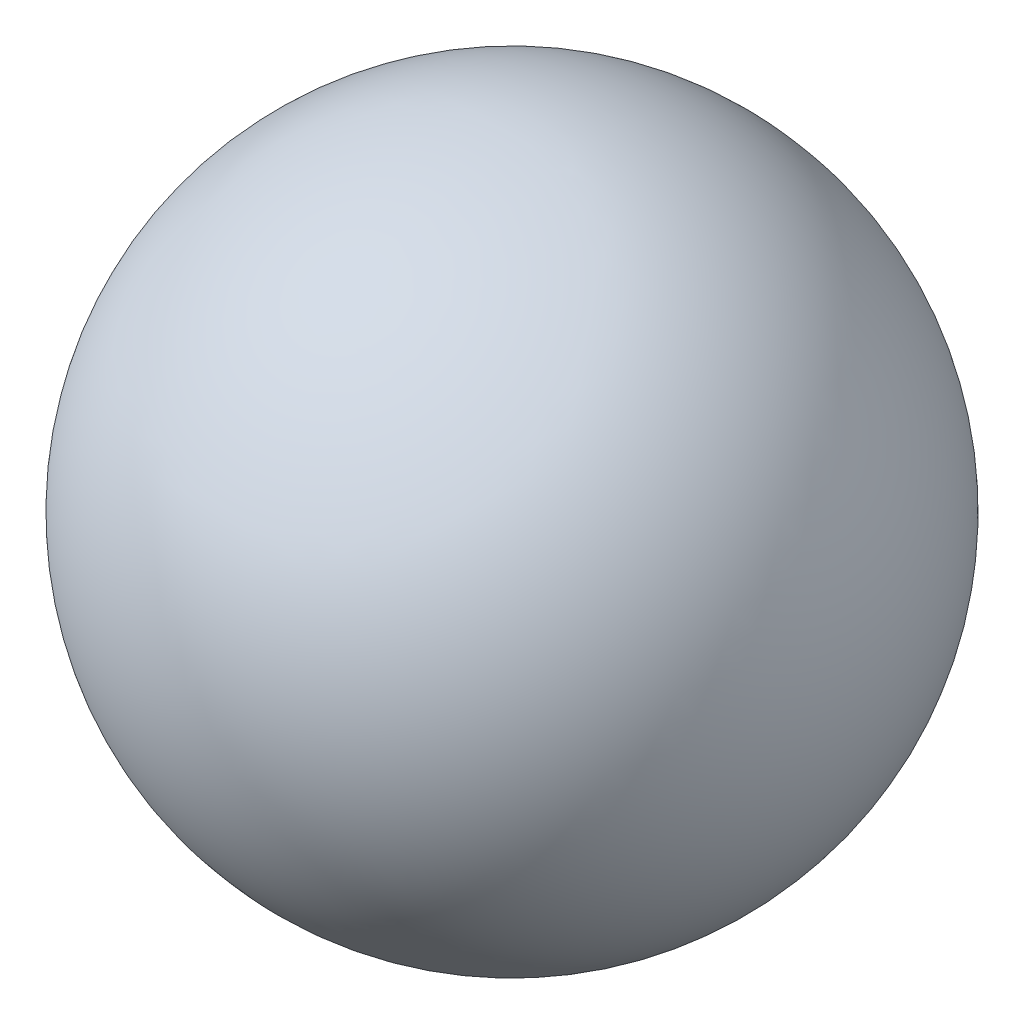
ISO-10303-21;
HEADER;
FILE_DESCRIPTION(('STEP AP214'),'2;1');
FILE_NAME('part.step','',(''),(''),'','','');
FILE_SCHEMA(('AUTOMOTIVE_DESIGN { 1 0 10303 214 1 1 1 1 }'));
ENDSEC;
DATA;
#1=APPLICATION_CONTEXT('core data for automotive mechanical design processes');
#2=APPLICATION_PROTOCOL_DEFINITION('international standard','automotive_design',2000,#1);
#3=PRODUCT_CONTEXT('',#1,'mechanical');
#4=PRODUCT('Part','Part','',(#3));
#5=PRODUCT_RELATED_PRODUCT_CATEGORY('part','',(#4));
#6=PRODUCT_DEFINITION_FORMATION('','',#4);
#7=PRODUCT_DEFINITION_CONTEXT('part definition',#1,'design');
#8=PRODUCT_DEFINITION('design','',#6,#7);
#9=PRODUCT_DEFINITION_SHAPE('','',#8);
#10=(LENGTH_UNIT() NAMED_UNIT(*) SI_UNIT(.MILLI.,.METRE.));
#11=(NAMED_UNIT(*) PLANE_ANGLE_UNIT() SI_UNIT($,.RADIAN.));
#12=(NAMED_UNIT(*) SI_UNIT($,.STERADIAN.) SOLID_ANGLE_UNIT());
#13=UNCERTAINTY_MEASURE_WITH_UNIT(LENGTH_MEASURE(1.E-05),#10,'distance_accuracy_value','');
#14=(GEOMETRIC_REPRESENTATION_CONTEXT(3) GLOBAL_UNCERTAINTY_ASSIGNED_CONTEXT((#13)) GLOBAL_UNIT_ASSIGNED_CONTEXT((#10,
#11,#12)) REPRESENTATION_CONTEXT('',''));
#15=CARTESIAN_POINT('',(0.,0.,0.));
#16=DIRECTION('',(0.,0.,1.));
#17=DIRECTION('',(1.,0.,0.));
#18=AXIS2_PLACEMENT_3D('',#15,#16,#17);
#19=CARTESIAN_POINT('',(67.76,36.5475393620934,-58.9351603274839));
#20=DIRECTION('',(0.,0.527020287134986,-0.84985270308928));
#21=DIRECTION('',(0.173648177666934,0.836941530920705,0.519013664765254));
#22=AXIS2_PLACEMENT_3D('',#19,#20,#21);
#23=SPHERICAL_SURFACE('',#22,7.15);
#24=CARTESIAN_POINT('',(67.76,40.3157344151086,-65.0116071545723));
#25=VERTEX_POINT('',#24);
#26=VERTEX_LOOP('',#25);
#27=FACE_BOUND('',#26,.T.);
#28=CARTESIAN_POINT('',(67.76,32.7793443090783,-52.8587135003955));
#29=VERTEX_POINT('',#28);
#30=VERTEX_LOOP('',#29);
#31=FACE_BOUND('',#30,.T.);
#32=ADVANCED_FACE('F16',(#27,#31),#23,.T.);
#33=CLOSED_SHELL('',(#32));
#34=MANIFOLD_SOLID_BREP('B1',#33);
#35=ADVANCED_BREP_SHAPE_REPRESENTATION('',(#18,#34),#14);
#36=SHAPE_DEFINITION_REPRESENTATION(#9,#35);
ENDSEC;
END-ISO-10303-21;
